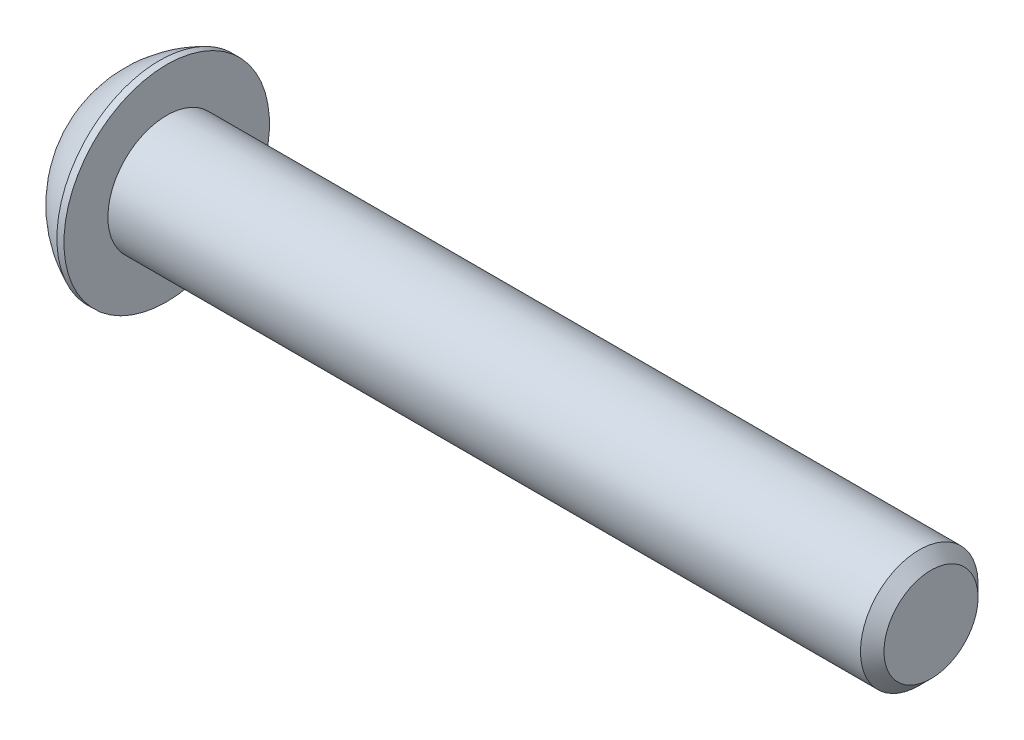
ISO-10303-21;
HEADER;
FILE_DESCRIPTION(('STEP AP214'),'2;1');
FILE_NAME('part.step','',(''),(''),'','','');
FILE_SCHEMA(('AUTOMOTIVE_DESIGN { 1 0 10303 214 1 1 1 1 }'));
ENDSEC;
DATA;
#1=APPLICATION_CONTEXT('core data for automotive mechanical design processes');
#2=APPLICATION_PROTOCOL_DEFINITION('international standard','automotive_design',2000,#1);
#3=PRODUCT_CONTEXT('',#1,'mechanical');
#4=PRODUCT('Part','Part','',(#3));
#5=PRODUCT_RELATED_PRODUCT_CATEGORY('part','',(#4));
#6=PRODUCT_DEFINITION_FORMATION('','',#4);
#7=PRODUCT_DEFINITION_CONTEXT('part definition',#1,'design');
#8=PRODUCT_DEFINITION('design','',#6,#7);
#9=PRODUCT_DEFINITION_SHAPE('','',#8);
#10=(LENGTH_UNIT() NAMED_UNIT(*) SI_UNIT(.MILLI.,.METRE.));
#11=(NAMED_UNIT(*) PLANE_ANGLE_UNIT() SI_UNIT($,.RADIAN.));
#12=(NAMED_UNIT(*) SI_UNIT($,.STERADIAN.) SOLID_ANGLE_UNIT());
#13=UNCERTAINTY_MEASURE_WITH_UNIT(LENGTH_MEASURE(1.E-05),#10,'distance_accuracy_value','');
#14=(GEOMETRIC_REPRESENTATION_CONTEXT(3) GLOBAL_UNCERTAINTY_ASSIGNED_CONTEXT((#13)) GLOBAL_UNIT_ASSIGNED_CONTEXT((#10,
#11,#12)) REPRESENTATION_CONTEXT('',''));
#15=CARTESIAN_POINT('',(0.,0.,0.));
#16=DIRECTION('',(0.,0.,1.));
#17=DIRECTION('',(1.,0.,0.));
#18=AXIS2_PLACEMENT_3D('',#15,#16,#17);
#19=CARTESIAN_POINT('',(1.32080000000268,0.,0.));
#20=DIRECTION('',(-1.,0.,0.));
#21=DIRECTION('',(0.,0.,1.));
#22=AXIS2_PLACEMENT_3D('',#19,#20,#21);
#23=CONICAL_SURFACE('',#22,1.19380000000158,1.04719755119668);
#24=CARTESIAN_POINT('',(2.01004075136213,0.,-4.44089209850063E-13));
#25=VERTEX_POINT('',#24);
#26=VERTEX_LOOP('',#25);
#27=FACE_BOUND('',#26,.T.);
#28=CARTESIAN_POINT('',(1.32080000000268,0.,0.));
#29=DIRECTION('',(-1.,0.,0.));
#30=DIRECTION('',(0.,0.,1.));
#31=AXIS2_PLACEMENT_3D('',#28,#29,#30);
#32=CIRCLE('',#31,1.19380000000158);
#33=CARTESIAN_POINT('',(1.32080000000268,0.,1.19380000000158));
#34=VERTEX_POINT('',#33);
#35=EDGE_CURVE('E19',#34,#34,#32,.T.);
#36=ORIENTED_EDGE('',*,*,#35,.T.);
#37=EDGE_LOOP('',(#36));
#38=FACE_BOUND('',#37,.T.);
#39=ADVANCED_FACE('F16',(#27,#38),#23,.F.);
#40=CARTESIAN_POINT('',(1.32080000000001,-2.29135888084638,0.));
#41=DIRECTION('',(1.,0.,0.));
#42=DIRECTION('',(0.,1.,0.));
#43=AXIS2_PLACEMENT_3D('',#40,#41,#42);
#44=PLANE('',#43);
#45=DIRECTION('',(0.,1.,0.));
#46=VECTOR('',#45,1.);
#47=CARTESIAN_POINT('',(1.32080000000001,-1.14567944042319,1.98437500000002));
#48=LINE('',#47,#46);
#49=CARTESIAN_POINT('',(1.32080000000001,1.14567944042317,1.98437500000007));
#50=VERTEX_POINT('',#49);
#51=CARTESIAN_POINT('',(1.32080000000001,-1.14567944042319,1.98437500000004));
#52=VERTEX_POINT('',#51);
#53=EDGE_CURVE('E68',#50,#52,#48,.F.);
#54=ORIENTED_EDGE('',*,*,#53,.F.);
#55=DIRECTION('',(0.,0.5,-0.866025403784439));
#56=VECTOR('',#55,1.);
#57=CARTESIAN_POINT('',(1.32080000000001,1.14567944042317,1.98437500000008));
#58=LINE('',#57,#56);
#59=CARTESIAN_POINT('',(1.32079999999979,2.29135888084634,0.));
#60=VERTEX_POINT('',#59);
#61=EDGE_CURVE('E291',#60,#50,#58,.F.);
#62=ORIENTED_EDGE('',*,*,#61,.F.);
#63=DIRECTION('',(0.,-0.5,-0.866025403784439));
#64=VECTOR('',#63,1.);
#65=CARTESIAN_POINT('',(1.32079999999957,2.29135888084633,0.));
#66=LINE('',#65,#64);
#67=CARTESIAN_POINT('',(1.3207999999999,1.14567944042317,-1.98437499999999));
#68=VERTEX_POINT('',#67);
#69=EDGE_CURVE('E295',#68,#60,#66,.F.);
#70=ORIENTED_EDGE('',*,*,#69,.F.);
#71=DIRECTION('',(0.,-1.,0.));
#72=VECTOR('',#71,1.);
#73=CARTESIAN_POINT('',(1.32080000000001,1.14567944042317,-1.984375));
#74=LINE('',#73,#72);
#75=CARTESIAN_POINT('',(1.32080000000001,-1.14567944042317,-1.98437499999998));
#76=VERTEX_POINT('',#75);
#77=EDGE_CURVE('E300',#76,#68,#74,.F.);
#78=ORIENTED_EDGE('',*,*,#77,.F.);
#79=DIRECTION('',(0.,-0.500000000000001,0.866025403784438));
#80=VECTOR('',#79,1.);
#81=CARTESIAN_POINT('',(1.32080000000001,-1.14567944042317,-1.98437499999997));
#82=LINE('',#81,#80);
#83=CARTESIAN_POINT('',(1.32080000000001,-2.29135888084637,0.));
#84=VERTEX_POINT('',#83);
#85=EDGE_CURVE('E305',#84,#76,#82,.F.);
#86=ORIENTED_EDGE('',*,*,#85,.F.);
#87=DIRECTION('',(0.,0.500000000000001,0.866025403784438));
#88=VECTOR('',#87,1.);
#89=CARTESIAN_POINT('',(1.32080000000001,-2.29135888084638,0.));
#90=LINE('',#89,#88);
#91=EDGE_CURVE('E81',#52,#84,#90,.F.);
#92=ORIENTED_EDGE('',*,*,#91,.F.);
#93=EDGE_LOOP('',(#54,#62,#70,#78,#86,#92));
#94=FACE_BOUND('',#93,.T.);
#95=ORIENTED_EDGE('',*,*,#35,.F.);
#96=EDGE_LOOP('',(#95));
#97=FACE_BOUND('',#96,.T.);
#98=ADVANCED_FACE('F74',(#94,#97),#44,.F.);
#99=CARTESIAN_POINT('',(1.32080000000001,-1.14567944042319,1.98437500000002));
#100=DIRECTION('',(0.,0.,-1.));
#101=DIRECTION('',(0.,1.,0.));
#102=AXIS2_PLACEMENT_3D('',#99,#100,#101);
#103=PLANE('',#102);
#104=ORIENTED_EDGE('',*,*,#53,.T.);
#105=DIRECTION('',(1.,0.,0.));
#106=VECTOR('',#105,1.);
#107=CARTESIAN_POINT('',(1.32080000000001,-1.14567944042321,1.98437500000002));
#108=LINE('',#107,#106);
#109=CARTESIAN_POINT('',(0.,-1.14567944042319,1.98437500000004));
#110=VERTEX_POINT('',#109);
#111=EDGE_CURVE('E78',#110,#52,#108,.T.);
#112=ORIENTED_EDGE('',*,*,#111,.F.);
#113=DIRECTION('',(0.,-1.,0.));
#114=VECTOR('',#113,1.);
#115=CARTESIAN_POINT('',(0.,0.,1.98437500000008));
#116=LINE('',#115,#114);
#117=CARTESIAN_POINT('',(0.,1.14567944042317,1.98437500000005));
#118=VERTEX_POINT('',#117);
#119=EDGE_CURVE('E285',#118,#110,#116,.T.);
#120=ORIENTED_EDGE('',*,*,#119,.F.);
#121=DIRECTION('',(1.,0.,0.));
#122=VECTOR('',#121,1.);
#123=CARTESIAN_POINT('',(1.32080000000001,1.14567944042317,1.98437500000008));
#124=LINE('',#123,#122);
#125=EDGE_CURVE('E288',#50,#118,#124,.F.);
#126=ORIENTED_EDGE('',*,*,#125,.F.);
#127=EDGE_LOOP('',(#104,#112,#120,#126));
#128=FACE_BOUND('',#127,.T.);
#129=ADVANCED_FACE('F127',(#128),#103,.T.);
#130=CARTESIAN_POINT('',(1.32080000000001,-2.29135888084638,0.));
#131=DIRECTION('',(0.,0.866025403784438,-0.500000000000001));
#132=DIRECTION('',(0.,0.500000000000001,0.866025403784438));
#133=AXIS2_PLACEMENT_3D('',#130,#131,#132);
#134=PLANE('',#133);
#135=ORIENTED_EDGE('',*,*,#91,.T.);
#136=DIRECTION('',(1.,0.,0.));
#137=VECTOR('',#136,1.);
#138=CARTESIAN_POINT('',(1.32080000000001,-2.29135888084634,0.));
#139=LINE('',#138,#137);
#140=CARTESIAN_POINT('',(0.,-2.29135888084637,0.));
#141=VERTEX_POINT('',#140);
#142=EDGE_CURVE('E307',#141,#84,#139,.T.);
#143=ORIENTED_EDGE('',*,*,#142,.F.);
#144=DIRECTION('',(0.,-0.500000000000006,-0.866025403784435));
#145=VECTOR('',#144,1.);
#146=CARTESIAN_POINT('',(0.,-1.14567944042319,1.98437500000001));
#147=LINE('',#146,#145);
#148=EDGE_CURVE('E282',#110,#141,#147,.T.);
#149=ORIENTED_EDGE('',*,*,#148,.F.);
#150=ORIENTED_EDGE('',*,*,#111,.T.);
#151=EDGE_LOOP('',(#135,#143,#149,#150));
#152=FACE_BOUND('',#151,.T.);
#153=ADVANCED_FACE('F123',(#152),#134,.T.);
#154=CARTESIAN_POINT('',(1.32080000000001,-1.14567944042317,-1.98437499999997));
#155=DIRECTION('',(0.,0.866025403784438,0.500000000000001));
#156=DIRECTION('',(0.,-0.500000000000001,0.866025403784438));
#157=AXIS2_PLACEMENT_3D('',#154,#155,#156);
#158=PLANE('',#157);
#159=ORIENTED_EDGE('',*,*,#85,.T.);
#160=DIRECTION('',(1.,0.,0.));
#161=VECTOR('',#160,1.);
#162=CARTESIAN_POINT('',(1.32079999999957,-1.14567944042317,-1.984375));
#163=LINE('',#162,#161);
#164=CARTESIAN_POINT('',(-1.1102230246258E-13,-1.14567944042317,-1.98437499999998));
#165=VERTEX_POINT('',#164);
#166=EDGE_CURVE('E302',#165,#76,#163,.T.);
#167=ORIENTED_EDGE('',*,*,#166,.F.);
#168=DIRECTION('',(0.,0.500000000000018,-0.866025403784428));
#169=VECTOR('',#168,1.);
#170=CARTESIAN_POINT('',(0.,-2.29135888084638,0.));
#171=LINE('',#170,#169);
#172=EDGE_CURVE('E279',#141,#165,#171,.T.);
#173=ORIENTED_EDGE('',*,*,#172,.F.);
#174=ORIENTED_EDGE('',*,*,#142,.T.);
#175=EDGE_LOOP('',(#159,#167,#173,#174));
#176=FACE_BOUND('',#175,.T.);
#177=ADVANCED_FACE('F119',(#176),#158,.T.);
#178=CARTESIAN_POINT('',(1.32079999999957,1.14567944042317,-1.984375));
#179=DIRECTION('',(0.,0.,1.));
#180=DIRECTION('',(0.,-1.,0.));
#181=AXIS2_PLACEMENT_3D('',#178,#179,#180);
#182=PLANE('',#181);
#183=ORIENTED_EDGE('',*,*,#77,.T.);
#184=DIRECTION('',(1.,0.,0.));
#185=VECTOR('',#184,1.);
#186=CARTESIAN_POINT('',(1.32080000000001,1.14567944042317,-1.984375));
#187=LINE('',#186,#185);
#188=CARTESIAN_POINT('',(-2.22044604925001E-13,1.14567944042317,-1.98437499999999));
#189=VERTEX_POINT('',#188);
#190=EDGE_CURVE('E297',#189,#68,#187,.T.);
#191=ORIENTED_EDGE('',*,*,#190,.F.);
#192=DIRECTION('',(0.,-1.,0.));
#193=VECTOR('',#192,1.);
#194=CARTESIAN_POINT('',(0.,0.,-1.98437499999997));
#195=LINE('',#194,#193);
#196=EDGE_CURVE('E276',#165,#189,#195,.F.);
#197=ORIENTED_EDGE('',*,*,#196,.F.);
#198=ORIENTED_EDGE('',*,*,#166,.T.);
#199=EDGE_LOOP('',(#183,#191,#197,#198));
#200=FACE_BOUND('',#199,.T.);
#201=ADVANCED_FACE('F116',(#200),#182,.T.);
#202=CARTESIAN_POINT('',(1.32080000000001,2.29135888084633,0.));
#203=DIRECTION('',(0.,-0.866025403784439,0.5));
#204=DIRECTION('',(0.,-0.5,-0.866025403784439));
#205=AXIS2_PLACEMENT_3D('',#202,#203,#204);
#206=PLANE('',#205);
#207=ORIENTED_EDGE('',*,*,#69,.T.);
#208=DIRECTION('',(1.,0.,0.));
#209=VECTOR('',#208,1.);
#210=CARTESIAN_POINT('',(1.32080000000001,2.29135888084636,0.));
#211=LINE('',#210,#209);
#212=CARTESIAN_POINT('',(0.,2.29135888084634,0.));
#213=VERTEX_POINT('',#212);
#214=EDGE_CURVE('E34',#213,#60,#211,.T.);
#215=ORIENTED_EDGE('',*,*,#214,.F.);
#216=DIRECTION('',(0.,0.499999999999999,0.866025403784439));
#217=VECTOR('',#216,1.);
#218=CARTESIAN_POINT('',(0.,1.14567944042317,-1.984375));
#219=LINE('',#218,#217);
#220=EDGE_CURVE('E273',#189,#213,#219,.T.);
#221=ORIENTED_EDGE('',*,*,#220,.F.);
#222=ORIENTED_EDGE('',*,*,#190,.T.);
#223=EDGE_LOOP('',(#207,#215,#221,#222));
#224=FACE_BOUND('',#223,.T.);
#225=ADVANCED_FACE('F112',(#224),#206,.T.);
#226=CARTESIAN_POINT('',(1.32080000000001,1.14567944042317,1.98437500000008));
#227=DIRECTION('',(0.,-0.866025403784439,-0.5));
#228=DIRECTION('',(0.,0.5,-0.866025403784439));
#229=AXIS2_PLACEMENT_3D('',#226,#227,#228);
#230=PLANE('',#229);
#231=ORIENTED_EDGE('',*,*,#61,.T.);
#232=ORIENTED_EDGE('',*,*,#125,.T.);
#233=DIRECTION('',(0.,-0.499999999999984,0.866025403784448));
#234=VECTOR('',#233,1.);
#235=CARTESIAN_POINT('',(0.,2.29135888084633,0.));
#236=LINE('',#235,#234);
#237=EDGE_CURVE('E99',#213,#118,#236,.T.);
#238=ORIENTED_EDGE('',*,*,#237,.F.);
#239=ORIENTED_EDGE('',*,*,#214,.T.);
#240=EDGE_LOOP('',(#231,#232,#238,#239));
#241=FACE_BOUND('',#240,.T.);
#242=ADVANCED_FACE('F108',(#241),#230,.T.);
#243=CARTESIAN_POINT('',(0.,0.,0.));
#244=DIRECTION('',(-1.,0.,0.));
#245=DIRECTION('',(0.,-1.,0.));
#246=AXIS2_PLACEMENT_3D('',#243,#244,#245);
#247=PLANE('',#246);
#248=ORIENTED_EDGE('',*,*,#220,.T.);
#249=ORIENTED_EDGE('',*,*,#237,.T.);
#250=ORIENTED_EDGE('',*,*,#119,.T.);
#251=ORIENTED_EDGE('',*,*,#148,.T.);
#252=ORIENTED_EDGE('',*,*,#172,.T.);
#253=ORIENTED_EDGE('',*,*,#196,.T.);
#254=EDGE_LOOP('',(#248,#249,#250,#251,#252,#253));
#255=FACE_BOUND('',#254,.T.);
#256=CARTESIAN_POINT('',(0.,2.77495,0.));
#257=CARTESIAN_POINT('',(0.,2.77494953309947,0.077911893752346));
#258=CARTESIAN_POINT('',(0.,2.77166578388025,0.15583810591977));
#259=CARTESIAN_POINT('',(0.,2.75855213600204,0.311152012455904));
#260=CARTESIAN_POINT('',(0.,2.74872030471467,0.388539541019556));
#261=CARTESIAN_POINT('',(0.,2.72255472645677,0.542341518735718));
#262=CARTESIAN_POINT('',(-2.70241452473078E-13,2.70621065843663,0.618754223567579));
#263=CARTESIAN_POINT('',(2.70461212307942E-13,2.66713326915777,0.769973634286024));
#264=CARTESIAN_POINT('',(1.00988985573598E-12,2.64439476297869,0.844778983646282));
#265=CARTESIAN_POINT('',(1.8144135030301E-12,2.5669019594335,1.06566239301792));
#266=CARTESIAN_POINT('',(4.75993428504827E-13,2.50280672569929,1.20857954243988));
#267=CARTESIAN_POINT('',(-4.76011524942789E-13,2.35149826934098,1.48160874561538));
#268=CARTESIAN_POINT('',(0.,2.26428416790396,1.61172031233499));
#269=CARTESIAN_POINT('',(0.,2.1181093928834,1.79445660654268));
#270=CARTESIAN_POINT('',(0.,2.06678693791626,1.85333128513997));
#271=CARTESIAN_POINT('',(0.,1.95940522984449,1.96650727912792));
#272=CARTESIAN_POINT('',(0.,1.90335059143535,2.02081294920044));
#273=CARTESIAN_POINT('',(0.,1.78683891013963,2.12453280878582));
#274=CARTESIAN_POINT('',(0.,1.72637988450322,2.1739447713554));
#275=CARTESIAN_POINT('',(0.,1.60151968865711,2.26750481692908));
#276=CARTESIAN_POINT('',(0.,1.53711760864537,2.31165167810847));
#277=CARTESIAN_POINT('',(0.,1.33869902291632,2.43567242603944));
#278=CARTESIAN_POINT('',(0.,1.19934704110695,2.507235886628));
#279=CARTESIAN_POINT('',(0.,0.910681609121881,2.62590828672821));
#280=CARTESIAN_POINT('',(0.,0.761368265357399,2.67301748742279));
#281=CARTESIAN_POINT('',(0.,0.456932649466624,2.74151230664007));
#282=CARTESIAN_POINT('',(0.,0.301810346322585,2.76289778778721));
#283=CARTESIAN_POINT('',(0.,-0.00982263870895204,2.77931595661155));
#284=CARTESIAN_POINT('',(0.,-0.166333320596449,2.77434864428877));
#285=CARTESIAN_POINT('',(0.,-0.476280836814452,2.73822217653073));
#286=CARTESIAN_POINT('',(0.,-0.629717687555985,2.70706316096981));
#287=CARTESIAN_POINT('',(0.,-0.929254830044275,2.61937980771149));
#288=CARTESIAN_POINT('',(0.,-1.0753550434132,2.56285519909568));
#289=CARTESIAN_POINT('',(0.,-1.28570692598579,2.46037024128109));
#290=CARTESIAN_POINT('',(0.,-1.35439130022287,2.42323494812896));
#291=CARTESIAN_POINT('',(0.,-1.488391287199,2.34331277270256));
#292=CARTESIAN_POINT('',(0.,-1.55370767631787,2.30052720108831));
#293=CARTESIAN_POINT('',(0.,-1.68047292776594,2.20962421887055));
#294=CARTESIAN_POINT('',(0.,-1.7419235278682,2.16150923122349));
#295=CARTESIAN_POINT('',(0.,-1.86060297067992,2.06024311301283));
#296=CARTESIAN_POINT('',(0.,-1.91782768181716,2.0070871669763));
#297=CARTESIAN_POINT('',(0.,-2.08239462196651,1.8407220856554));
#298=CARTESIAN_POINT('',(0.,-2.18279764272601,1.72049499758422));
#299=CARTESIAN_POINT('',(0.,-2.36195754944063,1.46487629213018));
#300=CARTESIAN_POINT('',(0.,-2.44071525816757,1.32948525142807));
#301=CARTESIAN_POINT('',(0.,-2.54098882695274,1.11796734074395));
#302=CARTESIAN_POINT('',(0.,-2.57146177392727,1.04596540008347));
#303=CARTESIAN_POINT('',(0.,-2.62621251108999,0.899689259475766));
#304=CARTESIAN_POINT('',(0.,-2.65049531495563,0.825416953360953));
#305=CARTESIAN_POINT('',(0.,-2.69267708798766,0.675215808695208));
#306=CARTESIAN_POINT('',(0.,-2.71058613777937,0.599289789313093));
#307=CARTESIAN_POINT('',(0.,-2.73994710360127,0.446213628496934));
#308=CARTESIAN_POINT('',(0.,-2.75140092413871,0.36906385502479));
#309=CARTESIAN_POINT('',(0.,-2.76470470685523,0.243162088173432));
#310=CARTESIAN_POINT('',(0.,-2.76854547596618,0.194611672428578));
#311=CARTESIAN_POINT('',(0.,-2.77366826843264,0.0973760351839819));
#312=CARTESIAN_POINT('',(0.,-2.77495029178814,0.04869081368424));
#313=CARTESIAN_POINT('',(0.,-2.77494953309947,-0.077911893752347));
#314=CARTESIAN_POINT('',(0.,-2.77166578388025,-0.155838105919771));
#315=CARTESIAN_POINT('',(0.,-2.75855213600204,-0.311152012455905));
#316=CARTESIAN_POINT('',(0.,-2.74872030471467,-0.388539541019557));
#317=CARTESIAN_POINT('',(0.,-2.72255472645677,-0.542341518735718));
#318=CARTESIAN_POINT('',(-2.70986635216127E-13,-2.70621065843663,-0.618754223567579));
#319=CARTESIAN_POINT('',(2.71207001030301E-13,-2.66713326915777,-0.769973634286023));
#320=CARTESIAN_POINT('',(1.01268841933287E-12,-2.64439476297869,-0.844778983646282));
#321=CARTESIAN_POINT('',(1.81922151867068E-12,-2.56690195943351,-1.06566239301792));
#322=CARTESIAN_POINT('',(4.76638764609873E-13,-2.50280672569929,-1.20857954243988));
#323=CARTESIAN_POINT('',(-4.76656885584179E-13,-2.35149826934097,-1.48160874561538));
#324=CARTESIAN_POINT('',(0.,-2.26428416790396,-1.61172031233499));
#325=CARTESIAN_POINT('',(0.,-2.1181093928834,-1.79445660654268));
#326=CARTESIAN_POINT('',(0.,-2.06678693791627,-1.85333128513996));
#327=CARTESIAN_POINT('',(0.,-1.95940522984449,-1.96650727912792));
#328=CARTESIAN_POINT('',(0.,-1.90335059143535,-2.02081294920044));
#329=CARTESIAN_POINT('',(0.,-1.78683891013963,-2.12453280878582));
#330=CARTESIAN_POINT('',(0.,-1.72637988450322,-2.1739447713554));
#331=CARTESIAN_POINT('',(0.,-1.60151968865711,-2.26750481692908));
#332=CARTESIAN_POINT('',(0.,-1.53711760864537,-2.31165167810847));
#333=CARTESIAN_POINT('',(0.,-1.33869902291632,-2.43567242603944));
#334=CARTESIAN_POINT('',(0.,-1.19934704110695,-2.507235886628));
#335=CARTESIAN_POINT('',(0.,-0.910681609121881,-2.62590828672821));
#336=CARTESIAN_POINT('',(0.,-0.761368265357398,-2.67301748742278));
#337=CARTESIAN_POINT('',(0.,-0.456932649466622,-2.74151230664007));
#338=CARTESIAN_POINT('',(0.,-0.301810346322583,-2.76289778778721));
#339=CARTESIAN_POINT('',(0.,0.0098226387089522,-2.77931595661156));
#340=CARTESIAN_POINT('',(0.,0.166333320596449,-2.77434864428877));
#341=CARTESIAN_POINT('',(0.,0.476280836814452,-2.73822217653073));
#342=CARTESIAN_POINT('',(0.,0.629717687555984,-2.70706316096981));
#343=CARTESIAN_POINT('',(0.,0.929254830044274,-2.61937980771149));
#344=CARTESIAN_POINT('',(0.,1.0753550434132,-2.56285519909569));
#345=CARTESIAN_POINT('',(0.,1.28570692598579,-2.46037024128109));
#346=CARTESIAN_POINT('',(0.,1.35439130022286,-2.42323494812896));
#347=CARTESIAN_POINT('',(0.,1.48839128719899,-2.34331277270256));
#348=CARTESIAN_POINT('',(0.,1.55370767631787,-2.30052720108831));
#349=CARTESIAN_POINT('',(0.,1.68047292776594,-2.20962421887055));
#350=CARTESIAN_POINT('',(0.,1.7419235278682,-2.16150923122349));
#351=CARTESIAN_POINT('',(0.,1.86060297067992,-2.06024311301283));
#352=CARTESIAN_POINT('',(0.,1.91782768181716,-2.0070871669763));
#353=CARTESIAN_POINT('',(0.,2.08239462196651,-1.8407220856554));
#354=CARTESIAN_POINT('',(0.,2.18279764272601,-1.72049499758422));
#355=CARTESIAN_POINT('',(0.,2.36195754944063,-1.46487629213018));
#356=CARTESIAN_POINT('',(0.,2.44071525816757,-1.32948525142807));
#357=CARTESIAN_POINT('',(0.,2.54098882695273,-1.11796734074395));
#358=CARTESIAN_POINT('',(0.,2.57146177392727,-1.04596540008347));
#359=CARTESIAN_POINT('',(0.,2.62621251108999,-0.899689259475766));
#360=CARTESIAN_POINT('',(0.,2.65049531495563,-0.825416953360953));
#361=CARTESIAN_POINT('',(0.,2.69267708798767,-0.675215808695208));
#362=CARTESIAN_POINT('',(0.,2.71058613777937,-0.599289789313092));
#363=CARTESIAN_POINT('',(0.,2.73994710360127,-0.446213628496933));
#364=CARTESIAN_POINT('',(0.,2.75140092413871,-0.369063855024789));
#365=CARTESIAN_POINT('',(0.,2.76470470685523,-0.243162088173432));
#366=CARTESIAN_POINT('',(0.,2.76854547596618,-0.194611672428578));
#367=CARTESIAN_POINT('',(0.,2.77366826843264,-0.0973760351839827));
#368=CARTESIAN_POINT('',(0.,2.77495029178814,-0.048690813684241));
#369=CARTESIAN_POINT('',(0.,2.77495,0.));
#370=B_SPLINE_CURVE_WITH_KNOTS('',3,(#256,#257,#258,#259,#260,#261,#262,#263,#264,#265,#266,
#267,#268,#269,#270,#271,#272,#273,#274,#275,#276,#277,#278,#279,#280,#281,#282,#283,#284,#285,
#286,#287,#288,#289,#290,#291,#292,#293,#294,#295,#296,#297,#298,#299,#300,#301,#302,#303,#304,
#305,#306,#307,#308,#309,#310,#311,#312,#313,#314,#315,#316,#317,#318,#319,#320,#321,#322,#323,
#324,#325,#326,#327,#328,#329,#330,#331,#332,#333,#334,#335,#336,#337,#338,#339,#340,#341,#342,
#343,#344,#345,#346,#347,#348,#349,#350,#351,#352,#353,#354,#355,#356,#357,#358,#359,#360,#361,
#362,#363,#364,#365,#366,#367,#368,#369),.UNSPECIFIED.,.T.,.F.,(4,2,2,2,2,2,2,2,2,2,2,2,2,2,2,2,
2,2,2,2,2,2,2,2,2,2,2,2,2,2,2,2,2,2,2,2,2,2,2,2,2,2,2,2,2,2,2,2,2,2,2,2,2,2,2,2,4),(0.,
0.233690856748163,0.467450716578752,0.701582538521472,0.935904756015415,1.40343220467667,
1.87097742791502,2.10505636898837,2.33890962270652,2.57286880998746,2.80688218486306,
3.27442101763127,3.74195485676357,4.20949119271389,4.67702752866418,5.14456136779641,
5.61210020056468,5.84611357544033,6.08007276272136,6.31392601643949,6.54800495751273,
7.01555018075072,7.48307762941212,7.71739984690652,7.95153166884955,8.18529152868023,
8.41898238542855,8.56502681353347,8.71107124163843,8.94476209838659,9.17852195821718,
9.4126537801599,9.64697599765384,10.1145034463151,10.5820486695534,10.8161276106268,
11.0499808643449,11.2839400516259,11.5179534265015,11.9854922592697,12.453026098402,
12.9205624343523,13.3880987703026,13.8556326094348,14.3231714422031,14.5571848170788,
14.7911440043598,15.0249972580779,15.2590761991512,15.7266214223891,16.1941488710506,
16.4284710885449,16.662602910488,16.8963627703186,17.130053627067,17.2760980551719,
17.4221424832769),.UNSPECIFIED.);
#371=CARTESIAN_POINT('',(0.,2.77495,0.));
#372=VERTEX_POINT('',#371);
#373=EDGE_CURVE('E93',#372,#372,#370,.T.);
#374=ORIENTED_EDGE('',*,*,#373,.F.);
#375=EDGE_LOOP('',(#374));
#376=FACE_BOUND('',#375,.T.);
#377=ADVANCED_FACE('F104',(#255,#376),#247,.T.);
#378=CARTESIAN_POINT('',(5.37260881410256,0.,0.));
#379=DIRECTION('',(0.,1.,0.));
#380=DIRECTION('',(1.,0.,0.));
#381=AXIS2_PLACEMENT_3D('',#378,#379,#380);
#382=SPHERICAL_SURFACE('',#381,6.04692260342999);
#383=CARTESIAN_POINT('',(2.97180000000002,0.,0.));
#384=DIRECTION('',(-1.,0.,0.));
#385=DIRECTION('',(0.,-1.,0.));
#386=AXIS2_PLACEMENT_3D('',#383,#384,#385);
#387=CIRCLE('',#386,5.54990000000002);
#388=CARTESIAN_POINT('',(2.97180000000002,-5.54990000000002,0.));
#389=VERTEX_POINT('',#388);
#390=EDGE_CURVE('E91',#389,#389,#387,.F.);
#391=ORIENTED_EDGE('',*,*,#390,.F.);
#392=EDGE_LOOP('',(#391));
#393=FACE_BOUND('',#392,.T.);
#394=ORIENTED_EDGE('',*,*,#373,.T.);
#395=EDGE_LOOP('',(#394));
#396=FACE_BOUND('',#395,.T.);
#397=ADVANCED_FACE('F100',(#393,#396),#382,.T.);
#398=CARTESIAN_POINT('',(44.6278,0.,1.11022302462516E-13));
#399=DIRECTION('',(-1.,0.,0.));
#400=DIRECTION('',(0.,-1.,0.));
#401=AXIS2_PLACEMENT_3D('',#398,#399,#400);
#402=PLANE('',#401);
#403=CARTESIAN_POINT('',(44.6277999999438,0.,1.11022302462516E-13));
#404=DIRECTION('',(-1.,0.,0.));
#405=DIRECTION('',(0.,0.,1.));
#406=AXIS2_PLACEMENT_3D('',#403,#404,#405);
#407=CIRCLE('',#406,2.54000000001031);
#408=CARTESIAN_POINT('',(44.6277999999438,0.,2.54000000001042));
#409=VERTEX_POINT('',#408);
#410=EDGE_CURVE('E88',#409,#409,#407,.T.);
#411=ORIENTED_EDGE('',*,*,#410,.F.);
#412=EDGE_LOOP('',(#411));
#413=FACE_BOUND('',#412,.T.);
#414=ADVANCED_FACE('F154',(#413),#402,.F.);
#415=CARTESIAN_POINT('',(0.,0.,0.));
#416=DIRECTION('',(-1.,0.,0.));
#417=DIRECTION('',(0.,-1.,0.));
#418=AXIS2_PLACEMENT_3D('',#415,#416,#417);
#419=CYLINDRICAL_SURFACE('',#418,5.54990000000002);
#420=ORIENTED_EDGE('',*,*,#390,.T.);
#421=EDGE_LOOP('',(#420));
#422=FACE_BOUND('',#421,.T.);
#423=CARTESIAN_POINT('',(3.35279999999999,0.,0.));
#424=DIRECTION('',(-1.,0.,0.));
#425=DIRECTION('',(0.,-1.,0.));
#426=AXIS2_PLACEMENT_3D('',#423,#424,#425);
#427=CIRCLE('',#426,5.54990000000002);
#428=CARTESIAN_POINT('',(3.35279999999999,-5.54990000000002,0.));
#429=VERTEX_POINT('',#428);
#430=EDGE_CURVE('E85',#429,#429,#427,.T.);
#431=ORIENTED_EDGE('',*,*,#430,.T.);
#432=EDGE_LOOP('',(#431));
#433=FACE_BOUND('',#432,.T.);
#434=ADVANCED_FACE('F151',(#422,#433),#419,.T.);
#435=CARTESIAN_POINT('',(43.9928000000691,0.,1.11022302462516E-13));
#436=DIRECTION('',(-1.,0.,0.));
#437=DIRECTION('',(0.,0.,1.));
#438=AXIS2_PLACEMENT_3D('',#435,#436,#437);
#439=CONICAL_SURFACE('',#438,3.17499999988502,0.785398163397448);
#440=CARTESIAN_POINT('',(43.9928,0.,0.));
#441=DIRECTION('',(-1.,0.,0.));
#442=DIRECTION('',(0.,-1.,0.));
#443=AXIS2_PLACEMENT_3D('',#440,#441,#442);
#444=CIRCLE('',#443,3.17500000000001);
#445=CARTESIAN_POINT('',(43.9928,-3.17500000000001,0.));
#446=VERTEX_POINT('',#445);
#447=EDGE_CURVE('E25',#446,#446,#444,.T.);
#448=ORIENTED_EDGE('',*,*,#447,.F.);
#449=EDGE_LOOP('',(#448));
#450=FACE_BOUND('',#449,.T.);
#451=ORIENTED_EDGE('',*,*,#410,.T.);
#452=EDGE_LOOP('',(#451));
#453=FACE_BOUND('',#452,.T.);
#454=ADVANCED_FACE('F144',(#450,#453),#439,.T.);
#455=CARTESIAN_POINT('',(3.35279999999955,3.17500000000001,0.));
#456=DIRECTION('',(-1.,0.,0.));
#457=DIRECTION('',(0.,-1.,0.));
#458=AXIS2_PLACEMENT_3D('',#455,#456,#457);
#459=PLANE('',#458);
#460=CARTESIAN_POINT('',(3.35279999999999,0.,0.));
#461=DIRECTION('',(-1.,0.,0.));
#462=DIRECTION('',(0.,-1.,0.));
#463=AXIS2_PLACEMENT_3D('',#460,#461,#462);
#464=CIRCLE('',#463,3.17500000000001);
#465=CARTESIAN_POINT('',(3.35279999999999,-3.17500000000001,0.));
#466=VERTEX_POINT('',#465);
#467=EDGE_CURVE('E11',#466,#466,#464,.F.);
#468=ORIENTED_EDGE('',*,*,#467,.F.);
#469=EDGE_LOOP('',(#468));
#470=FACE_BOUND('',#469,.T.);
#471=ORIENTED_EDGE('',*,*,#430,.F.);
#472=EDGE_LOOP('',(#471));
#473=FACE_BOUND('',#472,.T.);
#474=ADVANCED_FACE('F138',(#470,#473),#459,.F.);
#475=CARTESIAN_POINT('',(0.,0.,0.));
#476=DIRECTION('',(-1.,0.,0.));
#477=DIRECTION('',(0.,-1.,0.));
#478=AXIS2_PLACEMENT_3D('',#475,#476,#477);
#479=CYLINDRICAL_SURFACE('',#478,3.17500000000001);
#480=ORIENTED_EDGE('',*,*,#467,.T.);
#481=EDGE_LOOP('',(#480));
#482=FACE_BOUND('',#481,.T.);
#483=ORIENTED_EDGE('',*,*,#447,.T.);
#484=EDGE_LOOP('',(#483));
#485=FACE_BOUND('',#484,.T.);
#486=ADVANCED_FACE('F136',(#482,#485),#479,.T.);
#487=CLOSED_SHELL('',(#39,#98,#129,#153,#177,#201,#225,#242,#377,#397,#414,#434,#454,#474,#486));
#488=MANIFOLD_SOLID_BREP('B1',#487);
#489=ADVANCED_BREP_SHAPE_REPRESENTATION('',(#18,#488),#14);
#490=SHAPE_DEFINITION_REPRESENTATION(#9,#489);
ENDSEC;
END-ISO-10303-21;
